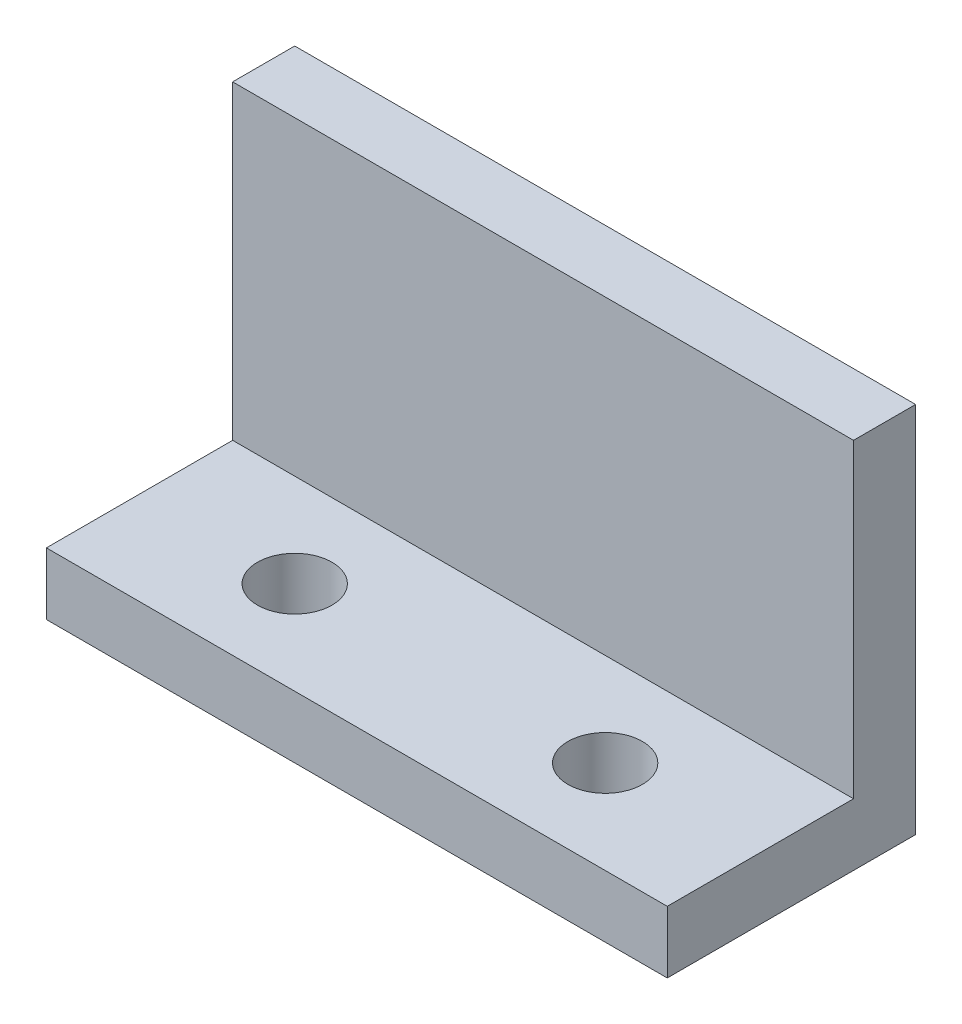
ISO-10303-21;
HEADER;
FILE_DESCRIPTION(('STEP AP214'),'2;1');
FILE_NAME('part.step','',(''),(''),'','','');
FILE_SCHEMA(('AUTOMOTIVE_DESIGN { 1 0 10303 214 1 1 1 1 }'));
ENDSEC;
DATA;
#1=APPLICATION_CONTEXT('core data for automotive mechanical design processes');
#2=APPLICATION_PROTOCOL_DEFINITION('international standard','automotive_design',2000,#1);
#3=PRODUCT_CONTEXT('',#1,'mechanical');
#4=PRODUCT('Part','Part','',(#3));
#5=PRODUCT_RELATED_PRODUCT_CATEGORY('part','',(#4));
#6=PRODUCT_DEFINITION_FORMATION('','',#4);
#7=PRODUCT_DEFINITION_CONTEXT('part definition',#1,'design');
#8=PRODUCT_DEFINITION('design','',#6,#7);
#9=PRODUCT_DEFINITION_SHAPE('','',#8);
#10=(LENGTH_UNIT() NAMED_UNIT(*) SI_UNIT(.MILLI.,.METRE.));
#11=(NAMED_UNIT(*) PLANE_ANGLE_UNIT() SI_UNIT($,.RADIAN.));
#12=(NAMED_UNIT(*) SI_UNIT($,.STERADIAN.) SOLID_ANGLE_UNIT());
#13=UNCERTAINTY_MEASURE_WITH_UNIT(LENGTH_MEASURE(1.E-05),#10,'distance_accuracy_value','');
#14=(GEOMETRIC_REPRESENTATION_CONTEXT(3) GLOBAL_UNCERTAINTY_ASSIGNED_CONTEXT((#13)) GLOBAL_UNIT_ASSIGNED_CONTEXT((#10,
#11,#12)) REPRESENTATION_CONTEXT('',''));
#15=CARTESIAN_POINT('',(0.,0.,0.));
#16=DIRECTION('',(0.,0.,1.));
#17=DIRECTION('',(1.,0.,0.));
#18=AXIS2_PLACEMENT_3D('',#15,#16,#17);
#19=CARTESIAN_POINT('',(0.,0.,10.));
#20=DIRECTION('',(0.,0.,-1.));
#21=DIRECTION('',(-1.,0.,0.));
#22=AXIS2_PLACEMENT_3D('',#19,#20,#21);
#23=PLANE('',#22);
#24=DIRECTION('',(-1.,0.,0.));
#25=VECTOR('',#24,1.);
#26=CARTESIAN_POINT('',(-50.,-20.,10.));
#27=LINE('',#26,#25);
#28=CARTESIAN_POINT('',(50.,-20.,10.));
#29=VERTEX_POINT('',#28);
#30=CARTESIAN_POINT('',(-50.,-20.,10.));
#31=VERTEX_POINT('',#30);
#32=EDGE_CURVE('E50',#29,#31,#27,.T.);
#33=ORIENTED_EDGE('',*,*,#32,.F.);
#34=DIRECTION('',(0.,1.,0.));
#35=VECTOR('',#34,1.);
#36=CARTESIAN_POINT('',(50.,-30.,10.));
#37=LINE('',#36,#35);
#38=CARTESIAN_POINT('',(50.,30.,10.));
#39=VERTEX_POINT('',#38);
#40=EDGE_CURVE('E88',#29,#39,#37,.T.);
#41=ORIENTED_EDGE('',*,*,#40,.T.);
#42=DIRECTION('',(-1.,0.,0.));
#43=VECTOR('',#42,1.);
#44=CARTESIAN_POINT('',(-50.,30.,10.));
#45=LINE('',#44,#43);
#46=CARTESIAN_POINT('',(-50.,30.,10.));
#47=VERTEX_POINT('',#46);
#48=EDGE_CURVE('E56',#39,#47,#45,.T.);
#49=ORIENTED_EDGE('',*,*,#48,.T.);
#50=DIRECTION('',(0.,-1.,0.));
#51=VECTOR('',#50,1.);
#52=CARTESIAN_POINT('',(-50.,-30.,10.));
#53=LINE('',#52,#51);
#54=EDGE_CURVE('E99',#47,#31,#53,.T.);
#55=ORIENTED_EDGE('',*,*,#54,.T.);
#56=EDGE_LOOP('',(#33,#41,#49,#55));
#57=FACE_BOUND('',#56,.T.);
#58=ADVANCED_FACE('F35',(#57),#23,.F.);
#59=CARTESIAN_POINT('',(50.,-30.,10.));
#60=DIRECTION('',(-1.,0.,0.));
#61=DIRECTION('',(0.,0.,1.));
#62=AXIS2_PLACEMENT_3D('',#59,#60,#61);
#63=PLANE('',#62);
#64=DIRECTION('',(0.,1.,0.));
#65=VECTOR('',#64,1.);
#66=CARTESIAN_POINT('',(50.,-30.,0.));
#67=LINE('',#66,#65);
#68=CARTESIAN_POINT('',(50.,-30.,0.));
#69=VERTEX_POINT('',#68);
#70=CARTESIAN_POINT('',(50.,30.,0.));
#71=VERTEX_POINT('',#70);
#72=EDGE_CURVE('E95',#69,#71,#67,.T.);
#73=ORIENTED_EDGE('',*,*,#72,.T.);
#74=DIRECTION('',(0.,0.,-1.));
#75=VECTOR('',#74,1.);
#76=CARTESIAN_POINT('',(50.,30.,10.));
#77=LINE('',#76,#75);
#78=EDGE_CURVE('E11',#39,#71,#77,.T.);
#79=ORIENTED_EDGE('',*,*,#78,.F.);
#80=ORIENTED_EDGE('',*,*,#40,.F.);
#81=DIRECTION('',(0.,0.,-1.));
#82=VECTOR('',#81,1.);
#83=CARTESIAN_POINT('',(50.,-20.,40.));
#84=LINE('',#83,#82);
#85=CARTESIAN_POINT('',(50.,-20.,40.));
#86=VERTEX_POINT('',#85);
#87=EDGE_CURVE('E103',#86,#29,#84,.T.);
#88=ORIENTED_EDGE('',*,*,#87,.F.);
#89=DIRECTION('',(0.,1.,0.));
#90=VECTOR('',#89,1.);
#91=CARTESIAN_POINT('',(50.,-30.,40.));
#92=LINE('',#91,#90);
#93=CARTESIAN_POINT('',(50.,-30.,40.));
#94=VERTEX_POINT('',#93);
#95=EDGE_CURVE('E98',#94,#86,#92,.T.);
#96=ORIENTED_EDGE('',*,*,#95,.F.);
#97=DIRECTION('',(0.,0.,-1.));
#98=VECTOR('',#97,1.);
#99=CARTESIAN_POINT('',(50.,-30.,10.));
#100=LINE('',#99,#98);
#101=EDGE_CURVE('E81',#94,#69,#100,.T.);
#102=ORIENTED_EDGE('',*,*,#101,.T.);
#103=EDGE_LOOP('',(#73,#79,#80,#88,#96,#102));
#104=FACE_BOUND('',#103,.T.);
#105=ADVANCED_FACE('F37',(#104),#63,.F.);
#106=CARTESIAN_POINT('',(-50.,30.,10.));
#107=DIRECTION('',(0.,-1.,0.));
#108=DIRECTION('',(0.,0.,-1.));
#109=AXIS2_PLACEMENT_3D('',#106,#107,#108);
#110=PLANE('',#109);
#111=DIRECTION('',(-1.,0.,0.));
#112=VECTOR('',#111,1.);
#113=CARTESIAN_POINT('',(-50.,30.,0.));
#114=LINE('',#113,#112);
#115=CARTESIAN_POINT('',(-50.,30.,0.));
#116=VERTEX_POINT('',#115);
#117=EDGE_CURVE('E102',#71,#116,#114,.T.);
#118=ORIENTED_EDGE('',*,*,#117,.T.);
#119=DIRECTION('',(0.,0.,-1.));
#120=VECTOR('',#119,1.);
#121=CARTESIAN_POINT('',(-50.,30.,10.));
#122=LINE('',#121,#120);
#123=EDGE_CURVE('E43',#47,#116,#122,.T.);
#124=ORIENTED_EDGE('',*,*,#123,.F.);
#125=ORIENTED_EDGE('',*,*,#48,.F.);
#126=ORIENTED_EDGE('',*,*,#78,.T.);
#127=EDGE_LOOP('',(#118,#124,#125,#126));
#128=FACE_BOUND('',#127,.T.);
#129=ADVANCED_FACE('F119',(#128),#110,.F.);
#130=CARTESIAN_POINT('',(-50.,-30.,10.));
#131=DIRECTION('',(1.,0.,0.));
#132=DIRECTION('',(0.,0.,-1.));
#133=AXIS2_PLACEMENT_3D('',#130,#131,#132);
#134=PLANE('',#133);
#135=DIRECTION('',(0.,-1.,0.));
#136=VECTOR('',#135,1.);
#137=CARTESIAN_POINT('',(-50.,-30.,0.));
#138=LINE('',#137,#136);
#139=CARTESIAN_POINT('',(-50.,-30.,0.));
#140=VERTEX_POINT('',#139);
#141=EDGE_CURVE('E89',#116,#140,#138,.T.);
#142=ORIENTED_EDGE('',*,*,#141,.T.);
#143=DIRECTION('',(0.,0.,-1.));
#144=VECTOR('',#143,1.);
#145=CARTESIAN_POINT('',(-50.,-30.,10.));
#146=LINE('',#145,#144);
#147=CARTESIAN_POINT('',(-50.,-30.,40.));
#148=VERTEX_POINT('',#147);
#149=EDGE_CURVE('E84',#148,#140,#146,.T.);
#150=ORIENTED_EDGE('',*,*,#149,.F.);
#151=DIRECTION('',(0.,-1.,0.));
#152=VECTOR('',#151,1.);
#153=CARTESIAN_POINT('',(-50.,-30.,40.));
#154=LINE('',#153,#152);
#155=CARTESIAN_POINT('',(-50.,-20.,40.));
#156=VERTEX_POINT('',#155);
#157=EDGE_CURVE('E139',#156,#148,#154,.T.);
#158=ORIENTED_EDGE('',*,*,#157,.F.);
#159=DIRECTION('',(0.,0.,-1.));
#160=VECTOR('',#159,1.);
#161=CARTESIAN_POINT('',(-50.,-20.,40.));
#162=LINE('',#161,#160);
#163=EDGE_CURVE('E107',#156,#31,#162,.T.);
#164=ORIENTED_EDGE('',*,*,#163,.T.);
#165=ORIENTED_EDGE('',*,*,#54,.F.);
#166=ORIENTED_EDGE('',*,*,#123,.T.);
#167=EDGE_LOOP('',(#142,#150,#158,#164,#165,#166));
#168=FACE_BOUND('',#167,.T.);
#169=ADVANCED_FACE('F116',(#168),#134,.F.);
#170=CARTESIAN_POINT('',(-50.,-30.,10.));
#171=DIRECTION('',(0.,1.,0.));
#172=DIRECTION('',(0.,0.,1.));
#173=AXIS2_PLACEMENT_3D('',#170,#171,#172);
#174=PLANE('',#173);
#175=CARTESIAN_POINT('',(25.,-30.,25.));
#176=DIRECTION('',(0.,1.,0.));
#177=DIRECTION('',(0.,0.,1.));
#178=AXIS2_PLACEMENT_3D('',#175,#176,#177);
#179=CIRCLE('',#178,6.);
#180=CARTESIAN_POINT('',(25.,-30.,31.));
#181=VERTEX_POINT('',#180);
#182=EDGE_CURVE('E156',#181,#181,#179,.T.);
#183=ORIENTED_EDGE('',*,*,#182,.T.);
#184=EDGE_LOOP('',(#183));
#185=FACE_BOUND('',#184,.T.);
#186=CARTESIAN_POINT('',(-25.,-30.,25.));
#187=DIRECTION('',(0.,1.,0.));
#188=DIRECTION('',(0.,0.,1.));
#189=AXIS2_PLACEMENT_3D('',#186,#187,#188);
#190=CIRCLE('',#189,6.);
#191=CARTESIAN_POINT('',(-25.,-30.,31.));
#192=VERTEX_POINT('',#191);
#193=EDGE_CURVE('E140',#192,#192,#190,.T.);
#194=ORIENTED_EDGE('',*,*,#193,.T.);
#195=EDGE_LOOP('',(#194));
#196=FACE_BOUND('',#195,.T.);
#197=DIRECTION('',(1.,0.,0.));
#198=VECTOR('',#197,1.);
#199=CARTESIAN_POINT('',(-50.,-30.,0.));
#200=LINE('',#199,#198);
#201=EDGE_CURVE('E76',#140,#69,#200,.T.);
#202=ORIENTED_EDGE('',*,*,#201,.T.);
#203=ORIENTED_EDGE('',*,*,#101,.F.);
#204=DIRECTION('',(1.,0.,0.));
#205=VECTOR('',#204,1.);
#206=CARTESIAN_POINT('',(-50.,-30.,40.));
#207=LINE('',#206,#205);
#208=EDGE_CURVE('E135',#148,#94,#207,.T.);
#209=ORIENTED_EDGE('',*,*,#208,.F.);
#210=ORIENTED_EDGE('',*,*,#149,.T.);
#211=EDGE_LOOP('',(#202,#203,#209,#210));
#212=FACE_BOUND('',#211,.T.);
#213=ADVANCED_FACE('F78',(#185,#196,#212),#174,.F.);
#214=CARTESIAN_POINT('',(0.,0.,0.));
#215=DIRECTION('',(0.,0.,-1.));
#216=DIRECTION('',(-1.,0.,0.));
#217=AXIS2_PLACEMENT_3D('',#214,#215,#216);
#218=PLANE('',#217);
#219=ORIENTED_EDGE('',*,*,#72,.F.);
#220=ORIENTED_EDGE('',*,*,#201,.F.);
#221=ORIENTED_EDGE('',*,*,#141,.F.);
#222=ORIENTED_EDGE('',*,*,#117,.F.);
#223=EDGE_LOOP('',(#219,#220,#221,#222));
#224=FACE_BOUND('',#223,.T.);
#225=ADVANCED_FACE('F101',(#224),#218,.T.);
#226=CARTESIAN_POINT('',(-50.,-20.,40.));
#227=DIRECTION('',(0.,-1.,0.));
#228=DIRECTION('',(0.,0.,-1.));
#229=AXIS2_PLACEMENT_3D('',#226,#227,#228);
#230=PLANE('',#229);
#231=CARTESIAN_POINT('',(25.,-20.,25.));
#232=DIRECTION('',(0.,1.,0.));
#233=DIRECTION('',(0.,0.,1.));
#234=AXIS2_PLACEMENT_3D('',#231,#232,#233);
#235=CIRCLE('',#234,5.99999999999999);
#236=CARTESIAN_POINT('',(25.,-20.,31.));
#237=VERTEX_POINT('',#236);
#238=EDGE_CURVE('E153',#237,#237,#235,.T.);
#239=ORIENTED_EDGE('',*,*,#238,.F.);
#240=EDGE_LOOP('',(#239));
#241=FACE_BOUND('',#240,.T.);
#242=CARTESIAN_POINT('',(-25.,-20.,25.));
#243=DIRECTION('',(0.,1.,0.));
#244=DIRECTION('',(0.,0.,1.));
#245=AXIS2_PLACEMENT_3D('',#242,#243,#244);
#246=CIRCLE('',#245,5.99999999999999);
#247=CARTESIAN_POINT('',(-25.,-20.,31.));
#248=VERTEX_POINT('',#247);
#249=EDGE_CURVE('E150',#248,#248,#246,.T.);
#250=ORIENTED_EDGE('',*,*,#249,.F.);
#251=EDGE_LOOP('',(#250));
#252=FACE_BOUND('',#251,.T.);
#253=ORIENTED_EDGE('',*,*,#32,.T.);
#254=ORIENTED_EDGE('',*,*,#163,.F.);
#255=DIRECTION('',(-1.,0.,0.));
#256=VECTOR('',#255,1.);
#257=CARTESIAN_POINT('',(-50.,-20.,40.));
#258=LINE('',#257,#256);
#259=EDGE_CURVE('E128',#86,#156,#258,.T.);
#260=ORIENTED_EDGE('',*,*,#259,.F.);
#261=ORIENTED_EDGE('',*,*,#87,.T.);
#262=EDGE_LOOP('',(#253,#254,#260,#261));
#263=FACE_BOUND('',#262,.T.);
#264=ADVANCED_FACE('F124',(#241,#252,#263),#230,.F.);
#265=CARTESIAN_POINT('',(0.,0.,40.));
#266=DIRECTION('',(0.,0.,-1.));
#267=DIRECTION('',(-1.,0.,0.));
#268=AXIS2_PLACEMENT_3D('',#265,#266,#267);
#269=PLANE('',#268);
#270=ORIENTED_EDGE('',*,*,#157,.T.);
#271=ORIENTED_EDGE('',*,*,#208,.T.);
#272=ORIENTED_EDGE('',*,*,#95,.T.);
#273=ORIENTED_EDGE('',*,*,#259,.T.);
#274=EDGE_LOOP('',(#270,#271,#272,#273));
#275=FACE_BOUND('',#274,.T.);
#276=ADVANCED_FACE('F145',(#275),#269,.F.);
#277=CARTESIAN_POINT('',(-25.,-20.,25.));
#278=DIRECTION('',(0.,1.,0.));
#279=DIRECTION('',(0.,0.,1.));
#280=AXIS2_PLACEMENT_3D('',#277,#278,#279);
#281=CYLINDRICAL_SURFACE('',#280,5.99999999999999);
#282=ORIENTED_EDGE('',*,*,#193,.F.);
#283=EDGE_LOOP('',(#282));
#284=FACE_BOUND('',#283,.T.);
#285=ORIENTED_EDGE('',*,*,#249,.T.);
#286=EDGE_LOOP('',(#285));
#287=FACE_BOUND('',#286,.T.);
#288=ADVANCED_FACE('F165',(#284,#287),#281,.F.);
#289=CARTESIAN_POINT('',(25.,-20.,25.));
#290=DIRECTION('',(0.,1.,0.));
#291=DIRECTION('',(0.,0.,1.));
#292=AXIS2_PLACEMENT_3D('',#289,#290,#291);
#293=CYLINDRICAL_SURFACE('',#292,5.99999999999999);
#294=ORIENTED_EDGE('',*,*,#182,.F.);
#295=EDGE_LOOP('',(#294));
#296=FACE_BOUND('',#295,.T.);
#297=ORIENTED_EDGE('',*,*,#238,.T.);
#298=EDGE_LOOP('',(#297));
#299=FACE_BOUND('',#298,.T.);
#300=ADVANCED_FACE('F162',(#296,#299),#293,.F.);
#301=CLOSED_SHELL('',(#58,#105,#129,#169,#213,#225,#264,#276,#288,#300));
#302=MANIFOLD_SOLID_BREP('B2',#301);
#303=ADVANCED_BREP_SHAPE_REPRESENTATION('',(#18,#302),#14);
#304=SHAPE_DEFINITION_REPRESENTATION(#9,#303);
ENDSEC;
END-ISO-10303-21;
